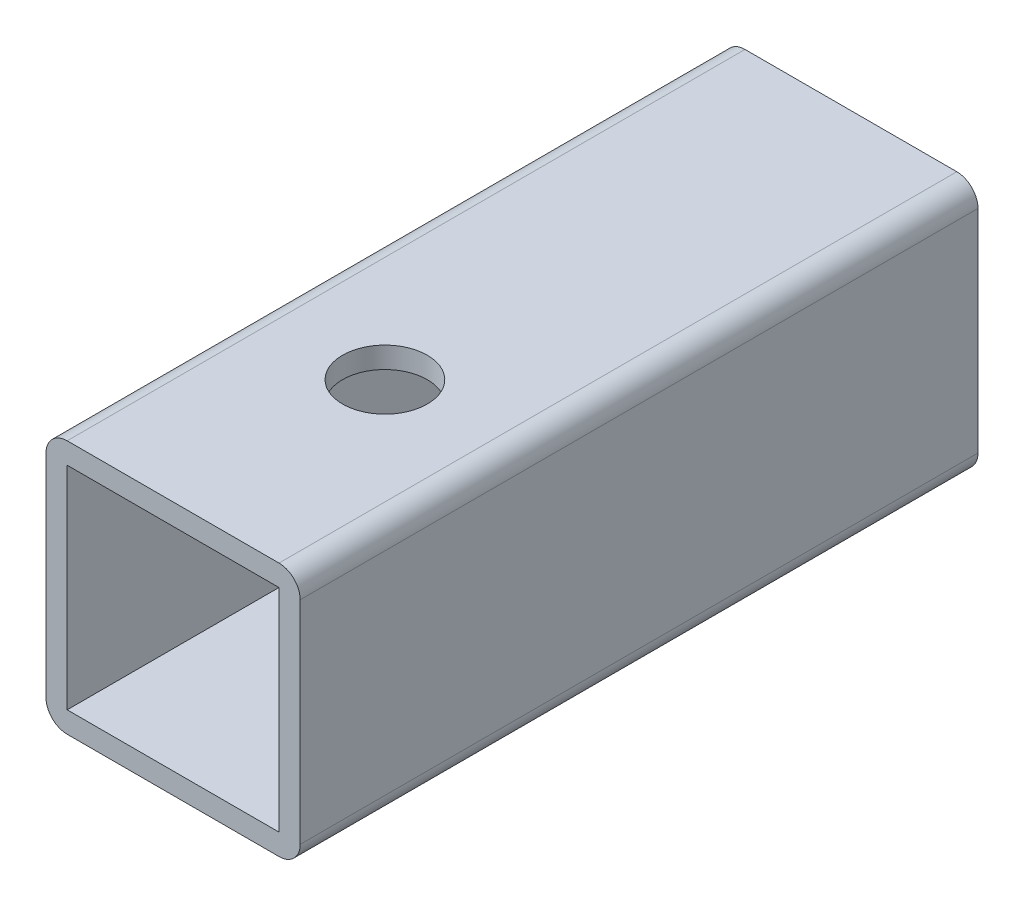
ISO-10303-21;
HEADER;
FILE_DESCRIPTION(('STEP AP214'),'2;1');
FILE_NAME('part.step','',(''),(''),'','','');
FILE_SCHEMA(('AUTOMOTIVE_DESIGN { 1 0 10303 214 1 1 1 1 }'));
ENDSEC;
DATA;
#1=APPLICATION_CONTEXT('core data for automotive mechanical design processes');
#2=APPLICATION_PROTOCOL_DEFINITION('international standard','automotive_design',2000,#1);
#3=PRODUCT_CONTEXT('',#1,'mechanical');
#4=PRODUCT('Part','Part','',(#3));
#5=PRODUCT_RELATED_PRODUCT_CATEGORY('part','',(#4));
#6=PRODUCT_DEFINITION_FORMATION('','',#4);
#7=PRODUCT_DEFINITION_CONTEXT('part definition',#1,'design');
#8=PRODUCT_DEFINITION('design','',#6,#7);
#9=PRODUCT_DEFINITION_SHAPE('','',#8);
#10=(LENGTH_UNIT() NAMED_UNIT(*) SI_UNIT(.MILLI.,.METRE.));
#11=(NAMED_UNIT(*) PLANE_ANGLE_UNIT() SI_UNIT($,.RADIAN.));
#12=(NAMED_UNIT(*) SI_UNIT($,.STERADIAN.) SOLID_ANGLE_UNIT());
#13=UNCERTAINTY_MEASURE_WITH_UNIT(LENGTH_MEASURE(1.E-05),#10,'distance_accuracy_value','');
#14=(GEOMETRIC_REPRESENTATION_CONTEXT(3) GLOBAL_UNCERTAINTY_ASSIGNED_CONTEXT((#13)) GLOBAL_UNIT_ASSIGNED_CONTEXT((#10,
#11,#12)) REPRESENTATION_CONTEXT('',''));
#15=CARTESIAN_POINT('',(0.,0.,0.));
#16=DIRECTION('',(0.,0.,1.));
#17=DIRECTION('',(1.,0.,0.));
#18=AXIS2_PLACEMENT_3D('',#15,#16,#17);
#19=CARTESIAN_POINT('',(19.05,19.05,101.6));
#20=DIRECTION('',(0.,0.,-1.));
#21=DIRECTION('',(-1.,0.,0.));
#22=AXIS2_PLACEMENT_3D('',#19,#20,#21);
#23=PLANE('',#22);
#24=DIRECTION('',(-1.,0.,0.));
#25=VECTOR('',#24,1.);
#26=CARTESIAN_POINT('',(-19.05,19.05,101.6));
#27=LINE('',#26,#25);
#28=CARTESIAN_POINT('',(15.875,19.05,101.6));
#29=VERTEX_POINT('',#28);
#30=CARTESIAN_POINT('',(-15.875,19.05,101.6));
#31=VERTEX_POINT('',#30);
#32=EDGE_CURVE('E173',#29,#31,#27,.T.);
#33=ORIENTED_EDGE('',*,*,#32,.T.);
#34=CARTESIAN_POINT('',(-15.875,15.875,101.6));
#35=DIRECTION('',(0.,0.,-1.));
#36=DIRECTION('',(-1.,0.,0.));
#37=AXIS2_PLACEMENT_3D('',#34,#35,#36);
#38=CIRCLE('',#37,3.175);
#39=CARTESIAN_POINT('',(-19.05,15.875,101.6));
#40=VERTEX_POINT('',#39);
#41=EDGE_CURVE('E213',#31,#40,#38,.F.);
#42=ORIENTED_EDGE('',*,*,#41,.T.);
#43=DIRECTION('',(0.,-1.,0.));
#44=VECTOR('',#43,1.);
#45=CARTESIAN_POINT('',(-19.05,-19.05,101.6));
#46=LINE('',#45,#44);
#47=CARTESIAN_POINT('',(-19.05,-15.875,101.6));
#48=VERTEX_POINT('',#47);
#49=EDGE_CURVE('E177',#40,#48,#46,.T.);
#50=ORIENTED_EDGE('',*,*,#49,.T.);
#51=CARTESIAN_POINT('',(-15.875,-15.875,101.6));
#52=DIRECTION('',(0.,0.,-1.));
#53=DIRECTION('',(-1.,0.,0.));
#54=AXIS2_PLACEMENT_3D('',#51,#52,#53);
#55=CIRCLE('',#54,3.175);
#56=CARTESIAN_POINT('',(-15.875,-19.05,101.6));
#57=VERTEX_POINT('',#56);
#58=EDGE_CURVE('E57',#48,#57,#55,.F.);
#59=ORIENTED_EDGE('',*,*,#58,.T.);
#60=DIRECTION('',(1.,0.,0.));
#61=VECTOR('',#60,1.);
#62=CARTESIAN_POINT('',(-19.05,-19.05,101.6));
#63=LINE('',#62,#61);
#64=CARTESIAN_POINT('',(15.875,-19.05,101.6));
#65=VERTEX_POINT('',#64);
#66=EDGE_CURVE('E179',#57,#65,#63,.T.);
#67=ORIENTED_EDGE('',*,*,#66,.T.);
#68=CARTESIAN_POINT('',(15.875,-15.875,101.6));
#69=DIRECTION('',(0.,0.,-1.));
#70=DIRECTION('',(-1.,0.,0.));
#71=AXIS2_PLACEMENT_3D('',#68,#69,#70);
#72=CIRCLE('',#71,3.175);
#73=CARTESIAN_POINT('',(19.05,-15.875,101.6));
#74=VERTEX_POINT('',#73);
#75=EDGE_CURVE('E210',#65,#74,#72,.F.);
#76=ORIENTED_EDGE('',*,*,#75,.T.);
#77=DIRECTION('',(0.,1.,0.));
#78=VECTOR('',#77,1.);
#79=CARTESIAN_POINT('',(19.05,-19.05,101.6));
#80=LINE('',#79,#78);
#81=CARTESIAN_POINT('',(19.05,15.875,101.6));
#82=VERTEX_POINT('',#81);
#83=EDGE_CURVE('E170',#74,#82,#80,.T.);
#84=ORIENTED_EDGE('',*,*,#83,.T.);
#85=CARTESIAN_POINT('',(15.875,15.875,101.6));
#86=DIRECTION('',(0.,0.,-1.));
#87=DIRECTION('',(-1.,0.,0.));
#88=AXIS2_PLACEMENT_3D('',#85,#86,#87);
#89=CIRCLE('',#88,3.175);
#90=EDGE_CURVE('E208',#82,#29,#89,.F.);
#91=ORIENTED_EDGE('',*,*,#90,.T.);
#92=EDGE_LOOP('',(#33,#42,#50,#59,#67,#76,#84,#91));
#93=FACE_BOUND('',#92,.T.);
#94=DIRECTION('',(0.,1.,0.));
#95=VECTOR('',#94,1.);
#96=CARTESIAN_POINT('',(15.875,-15.875,101.6));
#97=LINE('',#96,#95);
#98=CARTESIAN_POINT('',(15.875,-15.875,101.6));
#99=VERTEX_POINT('',#98);
#100=CARTESIAN_POINT('',(15.875,15.875,101.6));
#101=VERTEX_POINT('',#100);
#102=EDGE_CURVE('E127',#99,#101,#97,.T.);
#103=ORIENTED_EDGE('',*,*,#102,.F.);
#104=DIRECTION('',(1.,0.,0.));
#105=VECTOR('',#104,1.);
#106=CARTESIAN_POINT('',(-15.875,-15.875,101.6));
#107=LINE('',#106,#105);
#108=CARTESIAN_POINT('',(-15.875,-15.875,101.6));
#109=VERTEX_POINT('',#108);
#110=EDGE_CURVE('E152',#109,#99,#107,.T.);
#111=ORIENTED_EDGE('',*,*,#110,.F.);
#112=DIRECTION('',(0.,-1.,0.));
#113=VECTOR('',#112,1.);
#114=CARTESIAN_POINT('',(-15.875,-15.875,101.6));
#115=LINE('',#114,#113);
#116=CARTESIAN_POINT('',(-15.875,15.875,101.6));
#117=VERTEX_POINT('',#116);
#118=EDGE_CURVE('E150',#117,#109,#115,.T.);
#119=ORIENTED_EDGE('',*,*,#118,.F.);
#120=DIRECTION('',(-1.,0.,0.));
#121=VECTOR('',#120,1.);
#122=CARTESIAN_POINT('',(-15.875,15.875,101.6));
#123=LINE('',#122,#121);
#124=EDGE_CURVE('E137',#101,#117,#123,.T.);
#125=ORIENTED_EDGE('',*,*,#124,.F.);
#126=EDGE_LOOP('',(#103,#111,#119,#125));
#127=FACE_BOUND('',#126,.T.);
#128=ADVANCED_FACE('F34',(#93,#127),#23,.F.);
#129=CARTESIAN_POINT('',(19.05,19.05,0.));
#130=DIRECTION('',(0.,0.,-1.));
#131=DIRECTION('',(-1.,0.,0.));
#132=AXIS2_PLACEMENT_3D('',#129,#130,#131);
#133=PLANE('',#132);
#134=DIRECTION('',(0.,-1.,0.));
#135=VECTOR('',#134,1.);
#136=CARTESIAN_POINT('',(-19.05,-19.05,0.));
#137=LINE('',#136,#135);
#138=CARTESIAN_POINT('',(-19.05,15.875,0.));
#139=VERTEX_POINT('',#138);
#140=CARTESIAN_POINT('',(-19.05,-15.875,0.));
#141=VERTEX_POINT('',#140);
#142=EDGE_CURVE('E187',#139,#141,#137,.T.);
#143=ORIENTED_EDGE('',*,*,#142,.F.);
#144=CARTESIAN_POINT('',(-15.875,15.875,0.));
#145=DIRECTION('',(0.,0.,-1.));
#146=DIRECTION('',(-1.,0.,0.));
#147=AXIS2_PLACEMENT_3D('',#144,#145,#146);
#148=CIRCLE('',#147,3.175);
#149=CARTESIAN_POINT('',(-15.875,19.05,0.));
#150=VERTEX_POINT('',#149);
#151=EDGE_CURVE('E201',#139,#150,#148,.T.);
#152=ORIENTED_EDGE('',*,*,#151,.T.);
#153=DIRECTION('',(-1.,0.,0.));
#154=VECTOR('',#153,1.);
#155=CARTESIAN_POINT('',(-19.05,19.05,0.));
#156=LINE('',#155,#154);
#157=CARTESIAN_POINT('',(15.875,19.05,0.));
#158=VERTEX_POINT('',#157);
#159=EDGE_CURVE('E184',#158,#150,#156,.T.);
#160=ORIENTED_EDGE('',*,*,#159,.F.);
#161=CARTESIAN_POINT('',(15.875,15.875,0.));
#162=DIRECTION('',(0.,0.,-1.));
#163=DIRECTION('',(-1.,0.,0.));
#164=AXIS2_PLACEMENT_3D('',#161,#162,#163);
#165=CIRCLE('',#164,3.175);
#166=CARTESIAN_POINT('',(19.05,15.875,0.));
#167=VERTEX_POINT('',#166);
#168=EDGE_CURVE('E195',#158,#167,#165,.T.);
#169=ORIENTED_EDGE('',*,*,#168,.T.);
#170=DIRECTION('',(0.,1.,0.));
#171=VECTOR('',#170,1.);
#172=CARTESIAN_POINT('',(19.05,-19.05,0.));
#173=LINE('',#172,#171);
#174=CARTESIAN_POINT('',(19.05,-15.875,0.));
#175=VERTEX_POINT('',#174);
#176=EDGE_CURVE('E145',#175,#167,#173,.T.);
#177=ORIENTED_EDGE('',*,*,#176,.F.);
#178=CARTESIAN_POINT('',(15.875,-15.875,0.));
#179=DIRECTION('',(0.,0.,-1.));
#180=DIRECTION('',(-1.,0.,0.));
#181=AXIS2_PLACEMENT_3D('',#178,#179,#180);
#182=CIRCLE('',#181,3.175);
#183=CARTESIAN_POINT('',(15.875,-19.05,0.));
#184=VERTEX_POINT('',#183);
#185=EDGE_CURVE('E197',#175,#184,#182,.T.);
#186=ORIENTED_EDGE('',*,*,#185,.T.);
#187=DIRECTION('',(1.,0.,0.));
#188=VECTOR('',#187,1.);
#189=CARTESIAN_POINT('',(-19.05,-19.05,0.));
#190=LINE('',#189,#188);
#191=CARTESIAN_POINT('',(-15.875,-19.05,0.));
#192=VERTEX_POINT('',#191);
#193=EDGE_CURVE('E174',#192,#184,#190,.T.);
#194=ORIENTED_EDGE('',*,*,#193,.F.);
#195=CARTESIAN_POINT('',(-15.875,-15.875,0.));
#196=DIRECTION('',(0.,0.,-1.));
#197=DIRECTION('',(-1.,0.,0.));
#198=AXIS2_PLACEMENT_3D('',#195,#196,#197);
#199=CIRCLE('',#198,3.175);
#200=EDGE_CURVE('E199',#192,#141,#199,.T.);
#201=ORIENTED_EDGE('',*,*,#200,.T.);
#202=EDGE_LOOP('',(#143,#152,#160,#169,#177,#186,#194,#201));
#203=FACE_BOUND('',#202,.T.);
#204=DIRECTION('',(1.,0.,0.));
#205=VECTOR('',#204,1.);
#206=CARTESIAN_POINT('',(-15.875,-15.875,0.));
#207=LINE('',#206,#205);
#208=CARTESIAN_POINT('',(-15.875,-15.875,0.));
#209=VERTEX_POINT('',#208);
#210=CARTESIAN_POINT('',(15.875,-15.875,0.));
#211=VERTEX_POINT('',#210);
#212=EDGE_CURVE('E138',#209,#211,#207,.T.);
#213=ORIENTED_EDGE('',*,*,#212,.T.);
#214=DIRECTION('',(0.,1.,0.));
#215=VECTOR('',#214,1.);
#216=CARTESIAN_POINT('',(15.875,-15.875,0.));
#217=LINE('',#216,#215);
#218=CARTESIAN_POINT('',(15.875,15.875,0.));
#219=VERTEX_POINT('',#218);
#220=EDGE_CURVE('E157',#211,#219,#217,.T.);
#221=ORIENTED_EDGE('',*,*,#220,.T.);
#222=DIRECTION('',(-1.,0.,0.));
#223=VECTOR('',#222,1.);
#224=CARTESIAN_POINT('',(-15.875,15.875,0.));
#225=LINE('',#224,#223);
#226=CARTESIAN_POINT('',(-15.875,15.875,0.));
#227=VERTEX_POINT('',#226);
#228=EDGE_CURVE('E144',#219,#227,#225,.T.);
#229=ORIENTED_EDGE('',*,*,#228,.T.);
#230=DIRECTION('',(0.,-1.,0.));
#231=VECTOR('',#230,1.);
#232=CARTESIAN_POINT('',(-15.875,-15.875,0.));
#233=LINE('',#232,#231);
#234=EDGE_CURVE('E161',#227,#209,#233,.T.);
#235=ORIENTED_EDGE('',*,*,#234,.T.);
#236=EDGE_LOOP('',(#213,#221,#229,#235));
#237=FACE_BOUND('',#236,.T.);
#238=ADVANCED_FACE('F236',(#203,#237),#133,.T.);
#239=CARTESIAN_POINT('',(19.05,-19.05,101.6));
#240=DIRECTION('',(-1.,0.,0.));
#241=DIRECTION('',(0.,0.,1.));
#242=AXIS2_PLACEMENT_3D('',#239,#240,#241);
#243=PLANE('',#242);
#244=ORIENTED_EDGE('',*,*,#83,.F.);
#245=DIRECTION('',(0.,0.,-1.));
#246=VECTOR('',#245,1.);
#247=CARTESIAN_POINT('',(19.05,-15.875,101.6));
#248=LINE('',#247,#246);
#249=EDGE_CURVE('E11',#74,#175,#248,.T.);
#250=ORIENTED_EDGE('',*,*,#249,.T.);
#251=ORIENTED_EDGE('',*,*,#176,.T.);
#252=DIRECTION('',(0.,0.,-1.));
#253=VECTOR('',#252,1.);
#254=CARTESIAN_POINT('',(19.05,15.875,101.6));
#255=LINE('',#254,#253);
#256=EDGE_CURVE('E43',#167,#82,#255,.F.);
#257=ORIENTED_EDGE('',*,*,#256,.T.);
#258=EDGE_LOOP('',(#244,#250,#251,#257));
#259=FACE_BOUND('',#258,.T.);
#260=ADVANCED_FACE('F222',(#259),#243,.F.);
#261=CARTESIAN_POINT('',(-19.05,19.05,101.6));
#262=DIRECTION('',(0.,-1.,0.));
#263=DIRECTION('',(0.,0.,-1.));
#264=AXIS2_PLACEMENT_3D('',#261,#262,#263);
#265=PLANE('',#264);
#266=CARTESIAN_POINT('',(0.,19.05,69.85));
#267=DIRECTION('',(0.,-1.,0.));
#268=DIRECTION('',(0.,0.,-1.));
#269=AXIS2_PLACEMENT_3D('',#266,#267,#268);
#270=CIRCLE('',#269,6.34999999999999);
#271=CARTESIAN_POINT('',(0.,19.05,63.5));
#272=VERTEX_POINT('',#271);
#273=EDGE_CURVE('E304',#272,#272,#270,.T.);
#274=ORIENTED_EDGE('',*,*,#273,.T.);
#275=EDGE_LOOP('',(#274));
#276=FACE_BOUND('',#275,.T.);
#277=ORIENTED_EDGE('',*,*,#159,.T.);
#278=DIRECTION('',(0.,0.,-1.));
#279=VECTOR('',#278,1.);
#280=CARTESIAN_POINT('',(-15.875,19.05,101.6));
#281=LINE('',#280,#279);
#282=EDGE_CURVE('E206',#150,#31,#281,.F.);
#283=ORIENTED_EDGE('',*,*,#282,.T.);
#284=ORIENTED_EDGE('',*,*,#32,.F.);
#285=DIRECTION('',(0.,0.,-1.));
#286=VECTOR('',#285,1.);
#287=CARTESIAN_POINT('',(15.875,19.05,101.6));
#288=LINE('',#287,#286);
#289=EDGE_CURVE('E203',#29,#158,#288,.T.);
#290=ORIENTED_EDGE('',*,*,#289,.T.);
#291=EDGE_LOOP('',(#277,#283,#284,#290));
#292=FACE_BOUND('',#291,.T.);
#293=ADVANCED_FACE('F232',(#276,#292),#265,.F.);
#294=CARTESIAN_POINT('',(-19.05,-19.05,101.6));
#295=DIRECTION('',(1.,0.,0.));
#296=DIRECTION('',(0.,0.,-1.));
#297=AXIS2_PLACEMENT_3D('',#294,#295,#296);
#298=PLANE('',#297);
#299=ORIENTED_EDGE('',*,*,#49,.F.);
#300=DIRECTION('',(0.,0.,-1.));
#301=VECTOR('',#300,1.);
#302=CARTESIAN_POINT('',(-19.05,15.875,101.6));
#303=LINE('',#302,#301);
#304=EDGE_CURVE('E192',#40,#139,#303,.T.);
#305=ORIENTED_EDGE('',*,*,#304,.T.);
#306=ORIENTED_EDGE('',*,*,#142,.T.);
#307=DIRECTION('',(0.,0.,-1.));
#308=VECTOR('',#307,1.);
#309=CARTESIAN_POINT('',(-19.05,-15.875,101.6));
#310=LINE('',#309,#308);
#311=EDGE_CURVE('E181',#141,#48,#310,.F.);
#312=ORIENTED_EDGE('',*,*,#311,.T.);
#313=EDGE_LOOP('',(#299,#305,#306,#312));
#314=FACE_BOUND('',#313,.T.);
#315=ADVANCED_FACE('F244',(#314),#298,.F.);
#316=CARTESIAN_POINT('',(-19.05,-19.05,101.6));
#317=DIRECTION('',(0.,1.,0.));
#318=DIRECTION('',(0.,0.,1.));
#319=AXIS2_PLACEMENT_3D('',#316,#317,#318);
#320=PLANE('',#319);
#321=CARTESIAN_POINT('',(0.,-19.05,69.85));
#322=DIRECTION('',(0.,-1.,0.));
#323=DIRECTION('',(0.,0.,-1.));
#324=AXIS2_PLACEMENT_3D('',#321,#322,#323);
#325=CIRCLE('',#324,6.34999999999999);
#326=CARTESIAN_POINT('',(0.,-19.05,63.5));
#327=VERTEX_POINT('',#326);
#328=EDGE_CURVE('E308',#327,#327,#325,.T.);
#329=ORIENTED_EDGE('',*,*,#328,.F.);
#330=EDGE_LOOP('',(#329));
#331=FACE_BOUND('',#330,.T.);
#332=ORIENTED_EDGE('',*,*,#66,.F.);
#333=DIRECTION('',(0.,0.,-1.));
#334=VECTOR('',#333,1.);
#335=CARTESIAN_POINT('',(-15.875,-19.05,101.6));
#336=LINE('',#335,#334);
#337=EDGE_CURVE('E216',#57,#192,#336,.T.);
#338=ORIENTED_EDGE('',*,*,#337,.T.);
#339=ORIENTED_EDGE('',*,*,#193,.T.);
#340=DIRECTION('',(0.,0.,-1.));
#341=VECTOR('',#340,1.);
#342=CARTESIAN_POINT('',(15.875,-19.05,101.6));
#343=LINE('',#342,#341);
#344=EDGE_CURVE('E50',#184,#65,#343,.F.);
#345=ORIENTED_EDGE('',*,*,#344,.T.);
#346=EDGE_LOOP('',(#332,#338,#339,#345));
#347=FACE_BOUND('',#346,.T.);
#348=ADVANCED_FACE('F250',(#331,#347),#320,.F.);
#349=CARTESIAN_POINT('',(15.875,-15.875,101.6));
#350=DIRECTION('',(-1.,0.,0.));
#351=DIRECTION('',(0.,0.,1.));
#352=AXIS2_PLACEMENT_3D('',#349,#350,#351);
#353=PLANE('',#352);
#354=ORIENTED_EDGE('',*,*,#220,.F.);
#355=DIRECTION('',(0.,0.,-1.));
#356=VECTOR('',#355,1.);
#357=CARTESIAN_POINT('',(15.875,-15.875,101.6));
#358=LINE('',#357,#356);
#359=EDGE_CURVE('E133',#99,#211,#358,.T.);
#360=ORIENTED_EDGE('',*,*,#359,.F.);
#361=ORIENTED_EDGE('',*,*,#102,.T.);
#362=DIRECTION('',(0.,0.,-1.));
#363=VECTOR('',#362,1.);
#364=CARTESIAN_POINT('',(15.875,15.875,101.6));
#365=LINE('',#364,#363);
#366=EDGE_CURVE('E130',#101,#219,#365,.T.);
#367=ORIENTED_EDGE('',*,*,#366,.T.);
#368=EDGE_LOOP('',(#354,#360,#361,#367));
#369=FACE_BOUND('',#368,.T.);
#370=ADVANCED_FACE('F129',(#369),#353,.T.);
#371=CARTESIAN_POINT('',(-15.875,15.875,101.6));
#372=DIRECTION('',(0.,-1.,0.));
#373=DIRECTION('',(0.,0.,-1.));
#374=AXIS2_PLACEMENT_3D('',#371,#372,#373);
#375=PLANE('',#374);
#376=CARTESIAN_POINT('',(0.,15.875,69.85));
#377=DIRECTION('',(0.,-1.,0.));
#378=DIRECTION('',(0.,0.,-1.));
#379=AXIS2_PLACEMENT_3D('',#376,#377,#378);
#380=CIRCLE('',#379,6.34999999999999);
#381=CARTESIAN_POINT('',(0.,15.875,63.5));
#382=VERTEX_POINT('',#381);
#383=EDGE_CURVE('E159',#382,#382,#380,.T.);
#384=ORIENTED_EDGE('',*,*,#383,.F.);
#385=EDGE_LOOP('',(#384));
#386=FACE_BOUND('',#385,.T.);
#387=ORIENTED_EDGE('',*,*,#228,.F.);
#388=ORIENTED_EDGE('',*,*,#366,.F.);
#389=ORIENTED_EDGE('',*,*,#124,.T.);
#390=DIRECTION('',(0.,0.,-1.));
#391=VECTOR('',#390,1.);
#392=CARTESIAN_POINT('',(-15.875,15.875,101.6));
#393=LINE('',#392,#391);
#394=EDGE_CURVE('E146',#117,#227,#393,.T.);
#395=ORIENTED_EDGE('',*,*,#394,.T.);
#396=EDGE_LOOP('',(#387,#388,#389,#395));
#397=FACE_BOUND('',#396,.T.);
#398=ADVANCED_FACE('F141',(#386,#397),#375,.T.);
#399=CARTESIAN_POINT('',(-15.875,-15.875,101.6));
#400=DIRECTION('',(1.,0.,0.));
#401=DIRECTION('',(0.,0.,-1.));
#402=AXIS2_PLACEMENT_3D('',#399,#400,#401);
#403=PLANE('',#402);
#404=ORIENTED_EDGE('',*,*,#234,.F.);
#405=ORIENTED_EDGE('',*,*,#394,.F.);
#406=ORIENTED_EDGE('',*,*,#118,.T.);
#407=DIRECTION('',(0.,0.,-1.));
#408=VECTOR('',#407,1.);
#409=CARTESIAN_POINT('',(-15.875,-15.875,101.6));
#410=LINE('',#409,#408);
#411=EDGE_CURVE('E167',#109,#209,#410,.T.);
#412=ORIENTED_EDGE('',*,*,#411,.T.);
#413=EDGE_LOOP('',(#404,#405,#406,#412));
#414=FACE_BOUND('',#413,.T.);
#415=ADVANCED_FACE('F284',(#414),#403,.T.);
#416=CARTESIAN_POINT('',(-15.875,-15.875,101.6));
#417=DIRECTION('',(0.,1.,0.));
#418=DIRECTION('',(0.,0.,1.));
#419=AXIS2_PLACEMENT_3D('',#416,#417,#418);
#420=PLANE('',#419);
#421=CARTESIAN_POINT('',(0.,-15.875,69.85));
#422=DIRECTION('',(0.,1.,0.));
#423=DIRECTION('',(0.,0.,1.));
#424=AXIS2_PLACEMENT_3D('',#421,#422,#423);
#425=CIRCLE('',#424,6.34999999999999);
#426=CARTESIAN_POINT('',(0.,-15.875,76.2));
#427=VERTEX_POINT('',#426);
#428=EDGE_CURVE('E38',#427,#427,#425,.T.);
#429=ORIENTED_EDGE('',*,*,#428,.F.);
#430=EDGE_LOOP('',(#429));
#431=FACE_BOUND('',#430,.T.);
#432=ORIENTED_EDGE('',*,*,#212,.F.);
#433=ORIENTED_EDGE('',*,*,#411,.F.);
#434=ORIENTED_EDGE('',*,*,#110,.T.);
#435=ORIENTED_EDGE('',*,*,#359,.T.);
#436=EDGE_LOOP('',(#432,#433,#434,#435));
#437=FACE_BOUND('',#436,.T.);
#438=ADVANCED_FACE('F280',(#431,#437),#420,.T.);
#439=CARTESIAN_POINT('',(-15.875,15.875,101.6));
#440=DIRECTION('',(0.,0.,-1.));
#441=DIRECTION('',(-1.,0.,0.));
#442=AXIS2_PLACEMENT_3D('',#439,#440,#441);
#443=CYLINDRICAL_SURFACE('',#442,3.175);
#444=ORIENTED_EDGE('',*,*,#41,.F.);
#445=ORIENTED_EDGE('',*,*,#282,.F.);
#446=ORIENTED_EDGE('',*,*,#151,.F.);
#447=ORIENTED_EDGE('',*,*,#304,.F.);
#448=EDGE_LOOP('',(#444,#445,#446,#447));
#449=FACE_BOUND('',#448,.T.);
#450=ADVANCED_FACE('F241',(#449),#443,.T.);
#451=CARTESIAN_POINT('',(-15.875,-15.875,101.6));
#452=DIRECTION('',(0.,0.,-1.));
#453=DIRECTION('',(-1.,0.,0.));
#454=AXIS2_PLACEMENT_3D('',#451,#452,#453);
#455=CYLINDRICAL_SURFACE('',#454,3.175);
#456=ORIENTED_EDGE('',*,*,#58,.F.);
#457=ORIENTED_EDGE('',*,*,#311,.F.);
#458=ORIENTED_EDGE('',*,*,#200,.F.);
#459=ORIENTED_EDGE('',*,*,#337,.F.);
#460=EDGE_LOOP('',(#456,#457,#458,#459));
#461=FACE_BOUND('',#460,.T.);
#462=ADVANCED_FACE('F248',(#461),#455,.T.);
#463=CARTESIAN_POINT('',(15.875,-15.875,101.6));
#464=DIRECTION('',(0.,0.,-1.));
#465=DIRECTION('',(-1.,0.,0.));
#466=AXIS2_PLACEMENT_3D('',#463,#464,#465);
#467=CYLINDRICAL_SURFACE('',#466,3.175);
#468=ORIENTED_EDGE('',*,*,#75,.F.);
#469=ORIENTED_EDGE('',*,*,#344,.F.);
#470=ORIENTED_EDGE('',*,*,#185,.F.);
#471=ORIENTED_EDGE('',*,*,#249,.F.);
#472=EDGE_LOOP('',(#468,#469,#470,#471));
#473=FACE_BOUND('',#472,.T.);
#474=ADVANCED_FACE('F252',(#473),#467,.T.);
#475=CARTESIAN_POINT('',(15.875,15.875,101.6));
#476=DIRECTION('',(0.,0.,-1.));
#477=DIRECTION('',(-1.,0.,0.));
#478=AXIS2_PLACEMENT_3D('',#475,#476,#477);
#479=CYLINDRICAL_SURFACE('',#478,3.175);
#480=ORIENTED_EDGE('',*,*,#90,.F.);
#481=ORIENTED_EDGE('',*,*,#256,.F.);
#482=ORIENTED_EDGE('',*,*,#168,.F.);
#483=ORIENTED_EDGE('',*,*,#289,.F.);
#484=EDGE_LOOP('',(#480,#481,#482,#483));
#485=FACE_BOUND('',#484,.T.);
#486=ADVANCED_FACE('F36',(#485),#479,.T.);
#487=CARTESIAN_POINT('',(0.,-19.05,69.85));
#488=DIRECTION('',(0.,-1.,0.));
#489=DIRECTION('',(0.,0.,-1.));
#490=AXIS2_PLACEMENT_3D('',#487,#488,#489);
#491=CYLINDRICAL_SURFACE('',#490,6.34999999999999);
#492=ORIENTED_EDGE('',*,*,#428,.T.);
#493=EDGE_LOOP('',(#492));
#494=FACE_BOUND('',#493,.T.);
#495=ORIENTED_EDGE('',*,*,#328,.T.);
#496=EDGE_LOOP('',(#495));
#497=FACE_BOUND('',#496,.T.);
#498=ADVANCED_FACE('F258',(#494,#497),#491,.F.);
#499=ORIENTED_EDGE('',*,*,#383,.T.);
#500=EDGE_LOOP('',(#499));
#501=FACE_BOUND('',#500,.T.);
#502=ORIENTED_EDGE('',*,*,#273,.F.);
#503=EDGE_LOOP('',(#502));
#504=FACE_BOUND('',#503,.T.);
#505=ADVANCED_FACE('F313',(#501,#504),#491,.F.);
#506=CLOSED_SHELL('',(#128,#238,#260,#293,#315,#348,#370,#398,#415,#438,#450,#462,#474,#486,
#498,#505));
#507=MANIFOLD_SOLID_BREP('B2',#506);
#508=ADVANCED_BREP_SHAPE_REPRESENTATION('',(#18,#507),#14);
#509=SHAPE_DEFINITION_REPRESENTATION(#9,#508);
ENDSEC;
END-ISO-10303-21;
